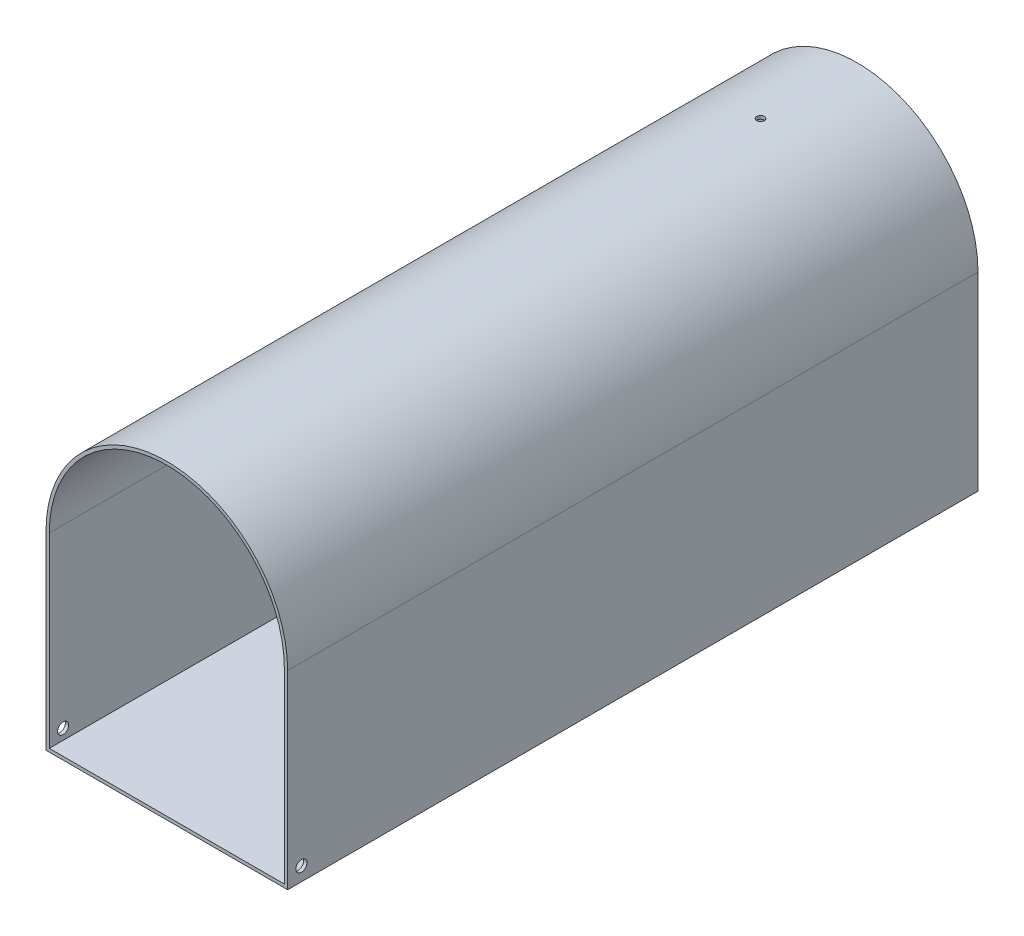
ISO-10303-21;
HEADER;
FILE_DESCRIPTION(('STEP AP214'),'2;1');
FILE_NAME('part.step','',(''),(''),'','','');
FILE_SCHEMA(('AUTOMOTIVE_DESIGN { 1 0 10303 214 1 1 1 1 }'));
ENDSEC;
DATA;
#1=APPLICATION_CONTEXT('core data for automotive mechanical design processes');
#2=APPLICATION_PROTOCOL_DEFINITION('international standard','automotive_design',2000,#1);
#3=PRODUCT_CONTEXT('',#1,'mechanical');
#4=PRODUCT('Part','Part','',(#3));
#5=PRODUCT_RELATED_PRODUCT_CATEGORY('part','',(#4));
#6=PRODUCT_DEFINITION_FORMATION('','',#4);
#7=PRODUCT_DEFINITION_CONTEXT('part definition',#1,'design');
#8=PRODUCT_DEFINITION('design','',#6,#7);
#9=PRODUCT_DEFINITION_SHAPE('','',#8);
#10=(LENGTH_UNIT() NAMED_UNIT(*) SI_UNIT(.MILLI.,.METRE.));
#11=(NAMED_UNIT(*) PLANE_ANGLE_UNIT() SI_UNIT($,.RADIAN.));
#12=(NAMED_UNIT(*) SI_UNIT($,.STERADIAN.) SOLID_ANGLE_UNIT());
#13=UNCERTAINTY_MEASURE_WITH_UNIT(LENGTH_MEASURE(1.E-05),#10,'distance_accuracy_value','');
#14=(GEOMETRIC_REPRESENTATION_CONTEXT(3) GLOBAL_UNCERTAINTY_ASSIGNED_CONTEXT((#13)) GLOBAL_UNIT_ASSIGNED_CONTEXT((#10,
#11,#12)) REPRESENTATION_CONTEXT('',''));
#15=CARTESIAN_POINT('',(0.,0.,0.));
#16=DIRECTION('',(0.,0.,1.));
#17=DIRECTION('',(1.,0.,0.));
#18=AXIS2_PLACEMENT_3D('',#15,#16,#17);
#19=CARTESIAN_POINT('',(175.,0.,500.));
#20=DIRECTION('',(-1.,0.,0.));
#21=DIRECTION('',(0.,0.,1.));
#22=AXIS2_PLACEMENT_3D('',#19,#20,#21);
#23=PLANE('',#22);
#24=CARTESIAN_POINT('',(175.,10.,490.));
#25=DIRECTION('',(1.,0.,0.));
#26=DIRECTION('',(0.,0.,-1.));
#27=AXIS2_PLACEMENT_3D('',#24,#25,#26);
#28=CIRCLE('',#27,3.99999999999999);
#29=CARTESIAN_POINT('',(175.,10.,486.));
#30=VERTEX_POINT('',#29);
#31=EDGE_CURVE('E178',#30,#30,#28,.T.);
#32=ORIENTED_EDGE('',*,*,#31,.F.);
#33=EDGE_LOOP('',(#32));
#34=FACE_BOUND('',#33,.T.);
#35=DIRECTION('',(0.,1.,0.));
#36=VECTOR('',#35,1.);
#37=CARTESIAN_POINT('',(175.,0.,0.));
#38=LINE('',#37,#36);
#39=CARTESIAN_POINT('',(175.,0.,0.));
#40=VERTEX_POINT('',#39);
#41=CARTESIAN_POINT('',(175.,137.5,0.));
#42=VERTEX_POINT('',#41);
#43=EDGE_CURVE('E151',#40,#42,#38,.T.);
#44=ORIENTED_EDGE('',*,*,#43,.T.);
#45=DIRECTION('',(0.,0.,-1.));
#46=VECTOR('',#45,1.);
#47=CARTESIAN_POINT('',(175.,137.5,500.));
#48=LINE('',#47,#46);
#49=CARTESIAN_POINT('',(175.,137.5,500.));
#50=VERTEX_POINT('',#49);
#51=EDGE_CURVE('E11',#50,#42,#48,.T.);
#52=ORIENTED_EDGE('',*,*,#51,.F.);
#53=DIRECTION('',(0.,1.,0.));
#54=VECTOR('',#53,1.);
#55=CARTESIAN_POINT('',(175.,0.,500.));
#56=LINE('',#55,#54);
#57=CARTESIAN_POINT('',(175.,0.,500.));
#58=VERTEX_POINT('',#57);
#59=EDGE_CURVE('E155',#58,#50,#56,.T.);
#60=ORIENTED_EDGE('',*,*,#59,.F.);
#61=DIRECTION('',(0.,0.,-1.));
#62=VECTOR('',#61,1.);
#63=CARTESIAN_POINT('',(175.,0.,500.));
#64=LINE('',#63,#62);
#65=EDGE_CURVE('E162',#58,#40,#64,.T.);
#66=ORIENTED_EDGE('',*,*,#65,.T.);
#67=EDGE_LOOP('',(#44,#52,#60,#66));
#68=FACE_BOUND('',#67,.T.);
#69=ADVANCED_FACE('F33',(#34,#68),#23,.F.);
#70=CARTESIAN_POINT('',(87.5,137.5,500.));
#71=DIRECTION('',(0.,0.,-1.));
#72=DIRECTION('',(-1.,0.,0.));
#73=AXIS2_PLACEMENT_3D('',#70,#71,#72);
#74=CYLINDRICAL_SURFACE('',#73,87.5);
#75=CARTESIAN_POINT('',(87.5,225.,72.75));
#76=CARTESIAN_POINT('',(87.3455722035873,224.999999418009,72.7499931643066));
#77=CARTESIAN_POINT('',(87.1910334034006,224.999586792793,72.7369483662961));
#78=CARTESIAN_POINT('',(86.8862146877911,224.997980416238,72.6850926709943));
#79=CARTESIAN_POINT('',(86.7359400793494,224.996785732559,72.6462510189216));
#80=CARTESIAN_POINT('',(86.4441097348615,224.993750529616,72.5439109571118));
#81=CARTESIAN_POINT('',(86.3025497631977,224.991910327057,72.4804246369307));
#82=CARTESIAN_POINT('',(86.0321360679246,224.987791639682,72.330614791368));
#83=CARTESIAN_POINT('',(85.9032792586622,224.985513261699,72.2442968307461));
#84=CARTESIAN_POINT('',(85.6618274124363,224.980773513335,72.0512250027508));
#85=CARTESIAN_POINT('',(85.5492391117796,224.978312067788,71.9444627122908));
#86=CARTESIAN_POINT('',(85.3435769963583,224.973484266261,71.7135477412892));
#87=CARTESIAN_POINT('',(85.2505039598667,224.971117914078,71.5893943675165));
#88=CARTESIAN_POINT('',(85.0865029350578,224.966746755959,71.3271953024204));
#89=CARTESIAN_POINT('',(85.01557912643,224.964742018293,71.1891469955326));
#90=CARTESIAN_POINT('',(84.8979169758935,224.961320871508,70.9030953658879));
#91=CARTESIAN_POINT('',(84.8511785322377,224.959904459914,70.7550920850142));
#92=CARTESIAN_POINT('',(84.7832286969561,224.957820240042,70.4533839058646));
#93=CARTESIAN_POINT('',(84.7620088145955,224.95715218277,70.2996809215949));
#94=CARTESIAN_POINT('',(84.7456722974305,224.95663924967,69.9908930497182));
#95=CARTESIAN_POINT('',(84.7505555528453,224.95679437038,69.8358081679258));
#96=CARTESIAN_POINT('',(84.7862795241058,224.95791006875,69.5287163986584));
#97=CARTESIAN_POINT('',(84.817111061672,224.958870361609,69.3767084422969));
#98=CARTESIAN_POINT('',(84.903842204061,224.961487703457,69.0800269733156));
#99=CARTESIAN_POINT('',(84.9597418668609,224.963144754057,68.9353534776597));
#100=CARTESIAN_POINT('',(85.0950330013448,224.966969144002,68.6574181582968));
#101=CARTESIAN_POINT('',(85.1744286786201,224.969136574687,68.5241583830616));
#102=CARTESIAN_POINT('',(85.3544549657792,224.973737297209,68.2728557389366));
#103=CARTESIAN_POINT('',(85.455085629744,224.976170589724,68.1548129088023));
#104=CARTESIAN_POINT('',(85.6747772661385,224.981030001657,67.9372414928392));
#105=CARTESIAN_POINT('',(85.7938461968194,224.983456117515,67.8377209425571));
#106=CARTESIAN_POINT('',(86.0470063602337,224.988026665954,67.6600809905292));
#107=CARTESIAN_POINT('',(86.1810975954575,224.990171098487,67.5819615923314));
#108=CARTESIAN_POINT('',(86.4605004703609,224.9939365808,67.4493423697882));
#109=CARTESIAN_POINT('',(86.6058122307563,224.995557624946,67.3948427995978));
#110=CARTESIAN_POINT('',(86.9035292529602,224.998093509004,67.3110154202992));
#111=CARTESIAN_POINT('',(87.0559344936058,224.999008351021,67.2816875360979));
#112=CARTESIAN_POINT('',(87.3634424104757,225.000028437271,67.2490458928877));
#113=CARTESIAN_POINT('',(87.518543905424,225.000134027517,67.2457210157265));
#114=CARTESIAN_POINT('',(87.8271028673331,224.999524624461,67.2651507922486));
#115=CARTESIAN_POINT('',(87.9805603363921,224.998809632207,67.2879054126427));
#116=CARTESIAN_POINT('',(88.2814441245271,224.996639865019,67.3588390599688));
#117=CARTESIAN_POINT('',(88.4288716352098,224.995185237018,67.4070130372574));
#118=CARTESIAN_POINT('',(88.7135471526609,224.991700105121,67.5274127862667));
#119=CARTESIAN_POINT('',(88.8507951368774,224.989669599948,67.59963861127));
#120=CARTESIAN_POINT('',(89.111266787543,224.985260573422,67.7661204413191));
#121=CARTESIAN_POINT('',(89.2344856705419,224.982881933993,67.8603839272124));
#122=CARTESIAN_POINT('',(89.4633533347245,224.978045094608,68.0682542992368));
#123=CARTESIAN_POINT('',(89.5690020673086,224.975586894431,68.1818612388708));
#124=CARTESIAN_POINT('',(89.7597675827809,224.970867066023,68.4252412797289));
#125=CARTESIAN_POINT('',(89.8448771903166,224.968605506665,68.5550200066342));
#126=CARTESIAN_POINT('',(89.9920994438726,224.964535027278,68.8270309792885));
#127=CARTESIAN_POINT('',(90.0542121443642,224.962726106178,68.9692631955386));
#128=CARTESIAN_POINT('',(90.1536648645093,224.959765349477,69.2621167035615));
#129=CARTESIAN_POINT('',(90.191009523448,224.958613390827,69.412736418545));
#130=CARTESIAN_POINT('',(90.2398812890438,224.957096095257,69.7181117058929));
#131=CARTESIAN_POINT('',(90.2514084251918,224.956730757439,69.8728672735327));
#132=CARTESIAN_POINT('',(90.248317399677,224.956827938998,70.1820495332186));
#133=CARTESIAN_POINT('',(90.233710552148,224.957290100129,70.3364763386184));
#134=CARTESIAN_POINT('',(90.178789471414,224.958989426753,70.640684597432));
#135=CARTESIAN_POINT('',(90.1384751873346,224.960226593779,70.7904660416521));
#136=CARTESIAN_POINT('',(90.0332852532423,224.963336410022,71.0811359313375));
#137=CARTESIAN_POINT('',(89.9684092007887,224.96520906965,71.222024231046));
#138=CARTESIAN_POINT('',(89.8159409610011,224.96937868695,71.4909065696625));
#139=CARTESIAN_POINT('',(89.7283495882986,224.971675629405,71.6189010707478));
#140=CARTESIAN_POINT('',(89.5329028263516,224.976435900392,71.8584151159102));
#141=CARTESIAN_POINT('',(89.4250408348583,224.978899282966,71.9699292710513));
#142=CARTESIAN_POINT('',(89.1920950352772,224.983714803824,72.1732975024345));
#143=CARTESIAN_POINT('',(89.0670069709895,224.986066914421,72.265146705508));
#144=CARTESIAN_POINT('',(88.8031082067468,224.990395613712,72.4265948572054));
#145=CARTESIAN_POINT('',(88.6642884358898,224.992371951625,72.4961789676923));
#146=CARTESIAN_POINT('',(88.3770374901751,224.995721896706,72.6109717603953));
#147=CARTESIAN_POINT('',(88.2286180084776,224.997096221874,72.6562094945093));
#148=CARTESIAN_POINT('',(87.9827181842513,224.998720183818,72.7090437018968));
#149=CARTESIAN_POINT('',(87.8868337524558,224.999198031019,72.7243829729099));
#150=CARTESIAN_POINT('',(87.6939808157713,224.999838121863,72.7448632674175));
#151=CARTESIAN_POINT('',(87.5970123112337,225.00000036561,72.7500042942167));
#152=CARTESIAN_POINT('',(87.5,225.,72.75));
#153=B_SPLINE_CURVE_WITH_KNOTS('',3,(#75,#76,#77,#78,#79,#80,#81,#82,#83,#84,#85,#86,#87,#88,
#89,#90,#91,#92,#93,#94,#95,#96,#97,#98,#99,#100,#101,#102,#103,#104,#105,#106,#107,#108,#109,
#110,#111,#112,#113,#114,#115,#116,#117,#118,#119,#120,#121,#122,#123,#124,#125,#126,#127,#128,
#129,#130,#131,#132,#133,#134,#135,#136,#137,#138,#139,#140,#141,#142,#143,#144,#145,#146,#147,
#148,#149,#150,#151,#152),.UNSPECIFIED.,.T.,.F.,(4,2,2,2,2,2,2,2,2,2,2,2,2,2,2,2,2,2,2,2,2,2,2,
2,2,2,2,2,2,2,2,2,2,2,2,2,2,2,4),(0.,0.462929280405694,0.926411454079281,1.38966655116432,
1.85280884288265,2.31614236188806,2.77949435522594,3.2429337330459,3.70637116117317,
4.1696543480829,4.63293558658303,5.09605302469927,5.55917153390823,6.02237298766895,
6.48557562111979,6.94897874037817,7.4123819364617,7.87579011875316,8.33919691858091,
8.80240556789411,9.26561362594363,9.72872970072806,10.1918468014724,10.6551213396018,
11.1183971591423,11.5818345907622,12.0452709246595,12.5086204280754,12.9719694022142,
13.4351178281377,13.8982671706236,14.3614241020645,14.8245644257671,15.287855859007,
15.751261967878,16.214976264592,16.6781359892746,16.9689505642838,17.2597650450517),.UNSPECIFIED.);
#154=CARTESIAN_POINT('',(87.5,225.,72.75));
#155=VERTEX_POINT('',#154);
#156=EDGE_CURVE('E183',#155,#155,#153,.T.);
#157=ORIENTED_EDGE('',*,*,#156,.T.);
#158=EDGE_LOOP('',(#157));
#159=FACE_BOUND('',#158,.T.);
#160=CARTESIAN_POINT('',(87.5,137.5,0.));
#161=DIRECTION('',(0.,0.,1.));
#162=DIRECTION('',(1.,0.,0.));
#163=AXIS2_PLACEMENT_3D('',#160,#161,#162);
#164=CIRCLE('',#163,87.5);
#165=CARTESIAN_POINT('',(0.,137.5,0.));
#166=VERTEX_POINT('',#165);
#167=EDGE_CURVE('E165',#42,#166,#164,.T.);
#168=ORIENTED_EDGE('',*,*,#167,.T.);
#169=DIRECTION('',(0.,0.,-1.));
#170=VECTOR('',#169,1.);
#171=CARTESIAN_POINT('',(0.,137.5,500.));
#172=LINE('',#171,#170);
#173=CARTESIAN_POINT('',(0.,137.5,500.));
#174=VERTEX_POINT('',#173);
#175=EDGE_CURVE('E46',#174,#166,#172,.T.);
#176=ORIENTED_EDGE('',*,*,#175,.F.);
#177=CARTESIAN_POINT('',(87.5,137.5,500.));
#178=DIRECTION('',(0.,0.,1.));
#179=DIRECTION('',(1.,0.,0.));
#180=AXIS2_PLACEMENT_3D('',#177,#178,#179);
#181=CIRCLE('',#180,87.5);
#182=EDGE_CURVE('E91',#50,#174,#181,.T.);
#183=ORIENTED_EDGE('',*,*,#182,.F.);
#184=ORIENTED_EDGE('',*,*,#51,.T.);
#185=EDGE_LOOP('',(#168,#176,#183,#184));
#186=FACE_BOUND('',#185,.T.);
#187=ADVANCED_FACE('F192',(#159,#186),#74,.T.);
#188=CARTESIAN_POINT('',(0.,0.,500.));
#189=DIRECTION('',(-1.,0.,0.));
#190=DIRECTION('',(0.,0.,1.));
#191=AXIS2_PLACEMENT_3D('',#188,#189,#190);
#192=PLANE('',#191);
#193=CARTESIAN_POINT('',(0.,10.,490.));
#194=DIRECTION('',(-1.,0.,0.));
#195=DIRECTION('',(0.,0.,1.));
#196=AXIS2_PLACEMENT_3D('',#193,#194,#195);
#197=CIRCLE('',#196,3.99999999999999);
#198=CARTESIAN_POINT('',(0.,10.,494.));
#199=VERTEX_POINT('',#198);
#200=EDGE_CURVE('E139',#199,#199,#197,.T.);
#201=ORIENTED_EDGE('',*,*,#200,.F.);
#202=EDGE_LOOP('',(#201));
#203=FACE_BOUND('',#202,.T.);
#204=DIRECTION('',(0.,1.,0.));
#205=VECTOR('',#204,1.);
#206=CARTESIAN_POINT('',(0.,0.,0.));
#207=LINE('',#206,#205);
#208=CARTESIAN_POINT('',(0.,0.,0.));
#209=VERTEX_POINT('',#208);
#210=EDGE_CURVE('E168',#209,#166,#207,.T.);
#211=ORIENTED_EDGE('',*,*,#210,.F.);
#212=DIRECTION('',(0.,0.,-1.));
#213=VECTOR('',#212,1.);
#214=CARTESIAN_POINT('',(0.,0.,500.));
#215=LINE('',#214,#213);
#216=CARTESIAN_POINT('',(0.,0.,500.));
#217=VERTEX_POINT('',#216);
#218=EDGE_CURVE('E173',#217,#209,#215,.T.);
#219=ORIENTED_EDGE('',*,*,#218,.F.);
#220=DIRECTION('',(0.,1.,0.));
#221=VECTOR('',#220,1.);
#222=CARTESIAN_POINT('',(0.,0.,500.));
#223=LINE('',#222,#221);
#224=EDGE_CURVE('E158',#217,#174,#223,.T.);
#225=ORIENTED_EDGE('',*,*,#224,.T.);
#226=ORIENTED_EDGE('',*,*,#175,.T.);
#227=EDGE_LOOP('',(#211,#219,#225,#226));
#228=FACE_BOUND('',#227,.T.);
#229=ADVANCED_FACE('F230',(#203,#228),#192,.T.);
#230=CARTESIAN_POINT('',(0.,0.,500.));
#231=DIRECTION('',(0.,1.,0.));
#232=DIRECTION('',(0.,0.,1.));
#233=AXIS2_PLACEMENT_3D('',#230,#231,#232);
#234=PLANE('',#233);
#235=DIRECTION('',(1.,0.,0.));
#236=VECTOR('',#235,1.);
#237=CARTESIAN_POINT('',(0.,0.,0.));
#238=LINE('',#237,#236);
#239=EDGE_CURVE('E84',#209,#40,#238,.T.);
#240=ORIENTED_EDGE('',*,*,#239,.T.);
#241=ORIENTED_EDGE('',*,*,#65,.F.);
#242=DIRECTION('',(1.,0.,0.));
#243=VECTOR('',#242,1.);
#244=CARTESIAN_POINT('',(0.,0.,500.));
#245=LINE('',#244,#243);
#246=EDGE_CURVE('E63',#217,#58,#245,.T.);
#247=ORIENTED_EDGE('',*,*,#246,.F.);
#248=ORIENTED_EDGE('',*,*,#218,.T.);
#249=EDGE_LOOP('',(#240,#241,#247,#248));
#250=FACE_BOUND('',#249,.T.);
#251=ADVANCED_FACE('F224',(#250),#234,.F.);
#252=CARTESIAN_POINT('',(87.5,137.5,500.));
#253=DIRECTION('',(0.,0.,1.));
#254=DIRECTION('',(1.,0.,0.));
#255=AXIS2_PLACEMENT_3D('',#252,#253,#254);
#256=PLANE('',#255);
#257=DIRECTION('',(1.,0.,0.));
#258=VECTOR('',#257,1.);
#259=CARTESIAN_POINT('',(2.38125,2.38125,500.));
#260=LINE('',#259,#258);
#261=CARTESIAN_POINT('',(2.38125,2.38125,500.));
#262=VERTEX_POINT('',#261);
#263=CARTESIAN_POINT('',(172.61875,2.38125,500.));
#264=VERTEX_POINT('',#263);
#265=EDGE_CURVE('E54',#262,#264,#260,.T.);
#266=ORIENTED_EDGE('',*,*,#265,.F.);
#267=DIRECTION('',(0.,-1.,0.));
#268=VECTOR('',#267,1.);
#269=CARTESIAN_POINT('',(2.38125,137.5,500.));
#270=LINE('',#269,#268);
#271=CARTESIAN_POINT('',(2.38125,137.5,500.));
#272=VERTEX_POINT('',#271);
#273=EDGE_CURVE('E133',#272,#262,#270,.T.);
#274=ORIENTED_EDGE('',*,*,#273,.F.);
#275=CARTESIAN_POINT('',(87.5,137.5,500.));
#276=DIRECTION('',(0.,0.,1.));
#277=DIRECTION('',(1.,0.,0.));
#278=AXIS2_PLACEMENT_3D('',#275,#276,#277);
#279=CIRCLE('',#278,85.11875);
#280=CARTESIAN_POINT('',(172.61875,137.5,500.));
#281=VERTEX_POINT('',#280);
#282=EDGE_CURVE('E136',#281,#272,#279,.T.);
#283=ORIENTED_EDGE('',*,*,#282,.F.);
#284=DIRECTION('',(0.,1.,0.));
#285=VECTOR('',#284,1.);
#286=CARTESIAN_POINT('',(172.61875,2.38125,500.));
#287=LINE('',#286,#285);
#288=EDGE_CURVE('E145',#264,#281,#287,.T.);
#289=ORIENTED_EDGE('',*,*,#288,.F.);
#290=EDGE_LOOP('',(#266,#274,#283,#289));
#291=FACE_BOUND('',#290,.T.);
#292=ORIENTED_EDGE('',*,*,#59,.T.);
#293=ORIENTED_EDGE('',*,*,#182,.T.);
#294=ORIENTED_EDGE('',*,*,#224,.F.);
#295=ORIENTED_EDGE('',*,*,#246,.T.);
#296=EDGE_LOOP('',(#292,#293,#294,#295));
#297=FACE_BOUND('',#296,.T.);
#298=ADVANCED_FACE('F221',(#291,#297),#256,.T.);
#299=CARTESIAN_POINT('',(87.5,137.5,0.));
#300=DIRECTION('',(0.,0.,1.));
#301=DIRECTION('',(1.,0.,0.));
#302=AXIS2_PLACEMENT_3D('',#299,#300,#301);
#303=PLANE('',#302);
#304=ORIENTED_EDGE('',*,*,#43,.F.);
#305=ORIENTED_EDGE('',*,*,#239,.F.);
#306=ORIENTED_EDGE('',*,*,#210,.T.);
#307=ORIENTED_EDGE('',*,*,#167,.F.);
#308=EDGE_LOOP('',(#304,#305,#306,#307));
#309=FACE_BOUND('',#308,.T.);
#310=ADVANCED_FACE('F220',(#309),#303,.F.);
#311=CARTESIAN_POINT('',(2.38125,2.38125,3.));
#312=DIRECTION('',(0.,-1.,0.));
#313=DIRECTION('',(0.,0.,-1.));
#314=AXIS2_PLACEMENT_3D('',#311,#312,#313);
#315=PLANE('',#314);
#316=ORIENTED_EDGE('',*,*,#265,.T.);
#317=DIRECTION('',(0.,0.,1.));
#318=VECTOR('',#317,1.);
#319=CARTESIAN_POINT('',(172.61875,2.38125,3.));
#320=LINE('',#319,#318);
#321=CARTESIAN_POINT('',(172.61875,2.38125,3.));
#322=VERTEX_POINT('',#321);
#323=EDGE_CURVE('E111',#322,#264,#320,.T.);
#324=ORIENTED_EDGE('',*,*,#323,.F.);
#325=DIRECTION('',(1.,0.,0.));
#326=VECTOR('',#325,1.);
#327=CARTESIAN_POINT('',(2.38125,2.38125,3.));
#328=LINE('',#327,#326);
#329=CARTESIAN_POINT('',(2.38125,2.38125,3.));
#330=VERTEX_POINT('',#329);
#331=EDGE_CURVE('E115',#330,#322,#328,.T.);
#332=ORIENTED_EDGE('',*,*,#331,.F.);
#333=DIRECTION('',(0.,0.,1.));
#334=VECTOR('',#333,1.);
#335=CARTESIAN_POINT('',(2.38125,2.38125,3.));
#336=LINE('',#335,#334);
#337=EDGE_CURVE('E149',#330,#262,#336,.T.);
#338=ORIENTED_EDGE('',*,*,#337,.T.);
#339=EDGE_LOOP('',(#316,#324,#332,#338));
#340=FACE_BOUND('',#339,.T.);
#341=ADVANCED_FACE('F113',(#340),#315,.F.);
#342=CARTESIAN_POINT('',(2.38125,137.5,3.));
#343=DIRECTION('',(-1.,0.,0.));
#344=DIRECTION('',(0.,-1.,0.));
#345=AXIS2_PLACEMENT_3D('',#342,#343,#344);
#346=PLANE('',#345);
#347=CARTESIAN_POINT('',(2.38124999999995,10.,490.));
#348=DIRECTION('',(-1.,0.,0.));
#349=DIRECTION('',(0.,-1.,0.));
#350=AXIS2_PLACEMENT_3D('',#347,#348,#349);
#351=CIRCLE('',#350,3.99999999999999);
#352=CARTESIAN_POINT('',(2.38124999999995,6.00000000000001,490.));
#353=VERTEX_POINT('',#352);
#354=EDGE_CURVE('E177',#353,#353,#351,.T.);
#355=ORIENTED_EDGE('',*,*,#354,.T.);
#356=EDGE_LOOP('',(#355));
#357=FACE_BOUND('',#356,.T.);
#358=ORIENTED_EDGE('',*,*,#273,.T.);
#359=ORIENTED_EDGE('',*,*,#337,.F.);
#360=DIRECTION('',(0.,-1.,0.));
#361=VECTOR('',#360,1.);
#362=CARTESIAN_POINT('',(2.38125,137.5,3.));
#363=LINE('',#362,#361);
#364=CARTESIAN_POINT('',(2.38125,137.5,3.));
#365=VERTEX_POINT('',#364);
#366=EDGE_CURVE('E121',#365,#330,#363,.T.);
#367=ORIENTED_EDGE('',*,*,#366,.F.);
#368=DIRECTION('',(0.,0.,1.));
#369=VECTOR('',#368,1.);
#370=CARTESIAN_POINT('',(2.38125,137.5,3.));
#371=LINE('',#370,#369);
#372=EDGE_CURVE('E152',#365,#272,#371,.T.);
#373=ORIENTED_EDGE('',*,*,#372,.T.);
#374=EDGE_LOOP('',(#358,#359,#367,#373));
#375=FACE_BOUND('',#374,.T.);
#376=ADVANCED_FACE('F208',(#357,#375),#346,.F.);
#377=CARTESIAN_POINT('',(87.5,137.5,3.));
#378=DIRECTION('',(0.,0.,1.));
#379=DIRECTION('',(1.,0.,0.));
#380=AXIS2_PLACEMENT_3D('',#377,#378,#379);
#381=CYLINDRICAL_SURFACE('',#380,85.11875);
#382=CARTESIAN_POINT('',(87.5,222.61875,72.75));
#383=CARTESIAN_POINT('',(87.6544254763277,222.618749401871,72.7499931651308));
#384=CARTESIAN_POINT('',(87.8089618996504,222.618325246086,72.7369487575347));
#385=CARTESIAN_POINT('',(88.1137757679065,222.61667398031,72.6850947033815));
#386=CARTESIAN_POINT('',(88.2640479083908,222.615445912383,72.6462543177505));
#387=CARTESIAN_POINT('',(88.5558733046154,222.612325890665,72.5439178176116));
#388=CARTESIAN_POINT('',(88.6974308021218,222.610434262907,72.4804338098483));
#389=CARTESIAN_POINT('',(88.9678400391586,222.606200463492,72.330629621669));
#390=CARTESIAN_POINT('',(89.0966948606569,222.603858401531,72.2443149993078));
#391=CARTESIAN_POINT('',(89.3381457354154,222.598986099832,72.0512490012467));
#392=CARTESIAN_POINT('',(89.4507347676511,222.596455779542,71.9444888463274));
#393=CARTESIAN_POINT('',(89.6563988796529,222.591492852213,71.7135780206471));
#394=CARTESIAN_POINT('',(89.7494731804811,222.589060249077,71.5894266560394));
#395=CARTESIAN_POINT('',(89.9134782742819,222.584566644138,71.3272296026566));
#396=CARTESIAN_POINT('',(89.9844046264932,222.582505716893,71.1891811347791));
#397=CARTESIAN_POINT('',(90.1020716700999,222.578988649963,70.9031283270833));
#398=CARTESIAN_POINT('',(90.1488124662639,222.577532507659,70.7551240303954));
#399=CARTESIAN_POINT('',(90.2167658870121,222.575389815692,70.4534159721803));
#400=CARTESIAN_POINT('',(90.2379874864845,222.574702995471,70.299714234011));
#401=CARTESIAN_POINT('',(90.2543277643657,222.574175577012,69.9909284766854));
#402=CARTESIAN_POINT('',(90.2494465561161,222.5743349751,69.835844463534));
#403=CARTESIAN_POINT('',(90.2137273476879,222.575481766359,69.5287573148414));
#404=CARTESIAN_POINT('',(90.1828990475687,222.576468850108,69.376753049711));
#405=CARTESIAN_POINT('',(90.0961757655911,222.579159253697,69.0800784186428));
#406=CARTESIAN_POINT('',(90.0402807239757,222.580862575244,68.9354080701894));
#407=CARTESIAN_POINT('',(89.9049994879739,222.584793800732,68.6574767214796));
#408=CARTESIAN_POINT('',(89.825608849635,222.587021803895,68.5242178857478));
#409=CARTESIAN_POINT('',(89.6455933250426,222.591751130295,68.2729160363214));
#410=CARTESIAN_POINT('',(89.5449683811569,222.594252454274,68.1548730639258));
#411=CARTESIAN_POINT('',(89.3252857612466,222.599247830252,67.9372972470884));
#412=CARTESIAN_POINT('',(89.2062196753035,222.601741878402,67.8377728937121));
#413=CARTESIAN_POINT('',(88.9530642838526,222.606440448791,67.6601248345244));
#414=CARTESIAN_POINT('',(88.8189749758181,222.608644970982,67.5820011323122));
#415=CARTESIAN_POINT('',(88.5395747169406,222.612516021406,67.449372966416));
#416=CARTESIAN_POINT('',(88.3942636380193,222.614182543498,67.3948687723576));
#417=CARTESIAN_POINT('',(88.0965468348913,222.616789639553,67.3110322359479));
#418=CARTESIAN_POINT('',(87.9441411330343,222.617730215802,67.2816998143053));
#419=CARTESIAN_POINT('',(87.6366351161769,222.618779103464,67.2490498757173));
#420=CARTESIAN_POINT('',(87.4815360498046,222.618887790729,67.245720610379));
#421=CARTESIAN_POINT('',(87.1729812186042,222.618261644793,67.2651408704933));
#422=CARTESIAN_POINT('',(87.0195254515555,222.617526812733,67.2878903606991));
#423=CARTESIAN_POINT('',(86.7186460528066,222.615296682306,67.3588126319794));
#424=CARTESIAN_POINT('',(86.5712211618101,222.613801543584,67.4069800760773));
#425=CARTESIAN_POINT('',(86.2865497078597,222.61021926608,67.5273655384395));
#426=CARTESIAN_POINT('',(86.1493031688018,222.608132125908,67.5995836131659));
#427=CARTESIAN_POINT('',(85.8888302927704,222.60359999876,67.7660505605722));
#428=CARTESIAN_POINT('',(85.7656090094112,222.601154883518,67.8603073371626));
#429=CARTESIAN_POINT('',(85.5367352113369,222.596182780749,68.0681644806722));
#430=CARTESIAN_POINT('',(85.4310827475808,222.593655792985,68.1817649036965));
#431=CARTESIAN_POINT('',(85.2403064224003,222.588803745459,68.4251349967779));
#432=CARTESIAN_POINT('',(85.1551901435669,222.586478760484,68.5549106124728));
#433=CARTESIAN_POINT('',(85.0079541684947,222.582294030918,68.8269169229904));
#434=CARTESIAN_POINT('',(84.9458344160818,222.580434285192,68.9691475873877));
#435=CARTESIAN_POINT('',(84.8463681269524,222.577390253941,69.2619980805151));
#436=CARTESIAN_POINT('',(84.8090166903582,222.576205834825,69.4126162435646));
#437=CARTESIAN_POINT('',(84.7601312445636,222.574645623916,69.7179898024446));
#438=CARTESIAN_POINT('',(84.748597201549,222.574269831064,69.8727451928563));
#439=CARTESIAN_POINT('',(84.751674510953,222.574369290777,70.1819244385284));
#440=CARTESIAN_POINT('',(84.7662739094265,222.574844154235,70.3363484130375));
#441=CARTESIAN_POINT('',(84.8211790779333,222.576590577058,70.6405522144369));
#442=CARTESIAN_POINT('',(84.8614848987827,222.577862137997,70.7903320321461));
#443=CARTESIAN_POINT('',(84.9666569834109,222.581058550454,71.0810000092866));
#444=CARTESIAN_POINT('',(85.0315236443609,222.582983412537,71.2218880248863));
#445=CARTESIAN_POINT('',(85.1839723968911,222.587269358507,71.4907715314852));
#446=CARTESIAN_POINT('',(85.2715536782404,222.589630426833,71.6187674821185));
#447=CARTESIAN_POINT('',(85.4669823741491,222.594523745215,71.8582894669441));
#448=CARTESIAN_POINT('',(85.5748368854803,222.597056055016,71.9698097092219));
#449=CARTESIAN_POINT('',(85.8077688356437,222.602006412635,72.1731914530644));
#450=CARTESIAN_POINT('',(85.9328505299677,222.604424432022,72.265048082921));
#451=CARTESIAN_POINT('',(86.1967395507798,222.60887455821,72.4265131626325));
#452=CARTESIAN_POINT('',(86.3355560956781,222.610906403115,72.4961065356231));
#453=CARTESIAN_POINT('',(86.6228026722091,222.614350558178,72.6109181534812));
#454=CARTESIAN_POINT('',(86.7712210121525,222.615763606109,72.6561654402424));
#455=CARTESIAN_POINT('',(87.0171462681317,222.617433639418,72.7090205272863));
#456=CARTESIAN_POINT('',(87.1130572200493,222.617925130304,72.7243684679754));
#457=CARTESIAN_POINT('',(87.3059641780807,222.618583498469,72.7448603500729));
#458=CARTESIAN_POINT('',(87.4029601838224,222.61875037586,72.7500042949808));
#459=CARTESIAN_POINT('',(87.5,222.61875,72.75));
#460=B_SPLINE_CURVE_WITH_KNOTS('',3,(#382,#383,#384,#385,#386,#387,#388,#389,#390,#391,#392,
#393,#394,#395,#396,#397,#398,#399,#400,#401,#402,#403,#404,#405,#406,#407,#408,#409,#410,#411,
#412,#413,#414,#415,#416,#417,#418,#419,#420,#421,#422,#423,#424,#425,#426,#427,#428,#429,#430,
#431,#432,#433,#434,#435,#436,#437,#438,#439,#440,#441,#442,#443,#444,#445,#446,#447,#448,#449,
#450,#451,#452,#453,#454,#455,#456,#457,#458,#459),.UNSPECIFIED.,.T.,.F.,(4,2,2,2,2,2,2,2,2,2,2,
2,2,2,2,2,2,2,2,2,2,2,2,2,2,2,2,2,2,2,2,2,2,2,2,2,2,2,4),(0.,0.462922218940796,
0.926397058629251,1.38964449324324,1.8527792550841,2.31611333261571,2.77946590077973,
3.24291131361051,3.70635471883978,4.16963508718311,4.63291344390897,5.09601868556585,
5.559125031232,6.02231902478249,6.48551427550993,6.94892138767865,7.41232857778533,
7.87574105772319,8.33915207790205,8.80235371388833,9.26555472383661,9.72865851471533,
10.1917633928016,10.6550346132251,11.1183071773612,11.5817505350934,12.0451927607556,
12.5085432769838,12.9718931863399,13.4350312045815,13.8981701383516,14.3613165618231,
14.8244464671266,15.2877387969137,15.7511457760078,16.2148659171053,16.6780316636838,
16.9689286290341,17.2598254946214),.UNSPECIFIED.);
#461=CARTESIAN_POINT('',(87.5,222.61875,72.75));
#462=VERTEX_POINT('',#461);
#463=EDGE_CURVE('E36',#462,#462,#460,.T.);
#464=ORIENTED_EDGE('',*,*,#463,.T.);
#465=EDGE_LOOP('',(#464));
#466=FACE_BOUND('',#465,.T.);
#467=ORIENTED_EDGE('',*,*,#282,.T.);
#468=ORIENTED_EDGE('',*,*,#372,.F.);
#469=CARTESIAN_POINT('',(87.5,137.5,3.));
#470=DIRECTION('',(0.,0.,1.));
#471=DIRECTION('',(1.,0.,0.));
#472=AXIS2_PLACEMENT_3D('',#469,#470,#471);
#473=CIRCLE('',#472,85.11875);
#474=CARTESIAN_POINT('',(172.61875,137.5,3.));
#475=VERTEX_POINT('',#474);
#476=EDGE_CURVE('E129',#475,#365,#473,.T.);
#477=ORIENTED_EDGE('',*,*,#476,.F.);
#478=DIRECTION('',(0.,0.,1.));
#479=VECTOR('',#478,1.);
#480=CARTESIAN_POINT('',(172.61875,137.5,3.));
#481=LINE('',#480,#479);
#482=EDGE_CURVE('E120',#475,#281,#481,.T.);
#483=ORIENTED_EDGE('',*,*,#482,.T.);
#484=EDGE_LOOP('',(#467,#468,#477,#483));
#485=FACE_BOUND('',#484,.T.);
#486=ADVANCED_FACE('F210',(#466,#485),#381,.F.);
#487=CARTESIAN_POINT('',(172.61875,2.38125,3.));
#488=DIRECTION('',(1.,0.,0.));
#489=DIRECTION('',(0.,0.,-1.));
#490=AXIS2_PLACEMENT_3D('',#487,#488,#489);
#491=PLANE('',#490);
#492=CARTESIAN_POINT('',(172.61875,10.,490.));
#493=DIRECTION('',(1.,0.,0.));
#494=DIRECTION('',(0.,0.,-1.));
#495=AXIS2_PLACEMENT_3D('',#492,#493,#494);
#496=CIRCLE('',#495,3.99999999999999);
#497=CARTESIAN_POINT('',(172.61875,10.,486.));
#498=VERTEX_POINT('',#497);
#499=EDGE_CURVE('E175',#498,#498,#496,.T.);
#500=ORIENTED_EDGE('',*,*,#499,.T.);
#501=EDGE_LOOP('',(#500));
#502=FACE_BOUND('',#501,.T.);
#503=ORIENTED_EDGE('',*,*,#288,.T.);
#504=ORIENTED_EDGE('',*,*,#482,.F.);
#505=DIRECTION('',(0.,1.,0.));
#506=VECTOR('',#505,1.);
#507=CARTESIAN_POINT('',(172.61875,2.38125,3.));
#508=LINE('',#507,#506);
#509=EDGE_CURVE('E124',#322,#475,#508,.T.);
#510=ORIENTED_EDGE('',*,*,#509,.F.);
#511=ORIENTED_EDGE('',*,*,#323,.T.);
#512=EDGE_LOOP('',(#503,#504,#510,#511));
#513=FACE_BOUND('',#512,.T.);
#514=ADVANCED_FACE('F125',(#502,#513),#491,.F.);
#515=CARTESIAN_POINT('',(87.5,137.5,3.));
#516=DIRECTION('',(0.,0.,1.));
#517=DIRECTION('',(1.,0.,0.));
#518=AXIS2_PLACEMENT_3D('',#515,#516,#517);
#519=PLANE('',#518);
#520=ORIENTED_EDGE('',*,*,#331,.T.);
#521=ORIENTED_EDGE('',*,*,#509,.T.);
#522=ORIENTED_EDGE('',*,*,#476,.T.);
#523=ORIENTED_EDGE('',*,*,#366,.T.);
#524=EDGE_LOOP('',(#520,#521,#522,#523));
#525=FACE_BOUND('',#524,.T.);
#526=ADVANCED_FACE('F131',(#525),#519,.T.);
#527=CARTESIAN_POINT('',(-322.,10.,490.));
#528=DIRECTION('',(1.,0.,0.));
#529=DIRECTION('',(0.,0.,-1.));
#530=AXIS2_PLACEMENT_3D('',#527,#528,#529);
#531=CYLINDRICAL_SURFACE('',#530,3.99999999999999);
#532=ORIENTED_EDGE('',*,*,#31,.T.);
#533=EDGE_LOOP('',(#532));
#534=FACE_BOUND('',#533,.T.);
#535=ORIENTED_EDGE('',*,*,#499,.F.);
#536=EDGE_LOOP('',(#535));
#537=FACE_BOUND('',#536,.T.);
#538=ADVANCED_FACE('F204',(#534,#537),#531,.F.);
#539=ORIENTED_EDGE('',*,*,#200,.T.);
#540=EDGE_LOOP('',(#539));
#541=FACE_BOUND('',#540,.T.);
#542=ORIENTED_EDGE('',*,*,#354,.F.);
#543=EDGE_LOOP('',(#542));
#544=FACE_BOUND('',#543,.T.);
#545=ADVANCED_FACE('F199',(#541,#544),#531,.F.);
#546=CARTESIAN_POINT('',(87.5,220.,70.));
#547=DIRECTION('',(0.,1.,0.));
#548=DIRECTION('',(0.,0.,1.));
#549=AXIS2_PLACEMENT_3D('',#546,#547,#548);
#550=CYLINDRICAL_SURFACE('',#549,2.75000000000001);
#551=ORIENTED_EDGE('',*,*,#463,.F.);
#552=EDGE_LOOP('',(#551));
#553=FACE_BOUND('',#552,.T.);
#554=ORIENTED_EDGE('',*,*,#156,.F.);
#555=EDGE_LOOP('',(#554));
#556=FACE_BOUND('',#555,.T.);
#557=ADVANCED_FACE('F195',(#553,#556),#550,.F.);
#558=CLOSED_SHELL('',(#69,#187,#229,#251,#298,#310,#341,#376,#486,#514,#526,#538,#545,#557));
#559=MANIFOLD_SOLID_BREP('B2',#558);
#560=ADVANCED_BREP_SHAPE_REPRESENTATION('',(#18,#559),#14);
#561=SHAPE_DEFINITION_REPRESENTATION(#9,#560);
ENDSEC;
END-ISO-10303-21;
